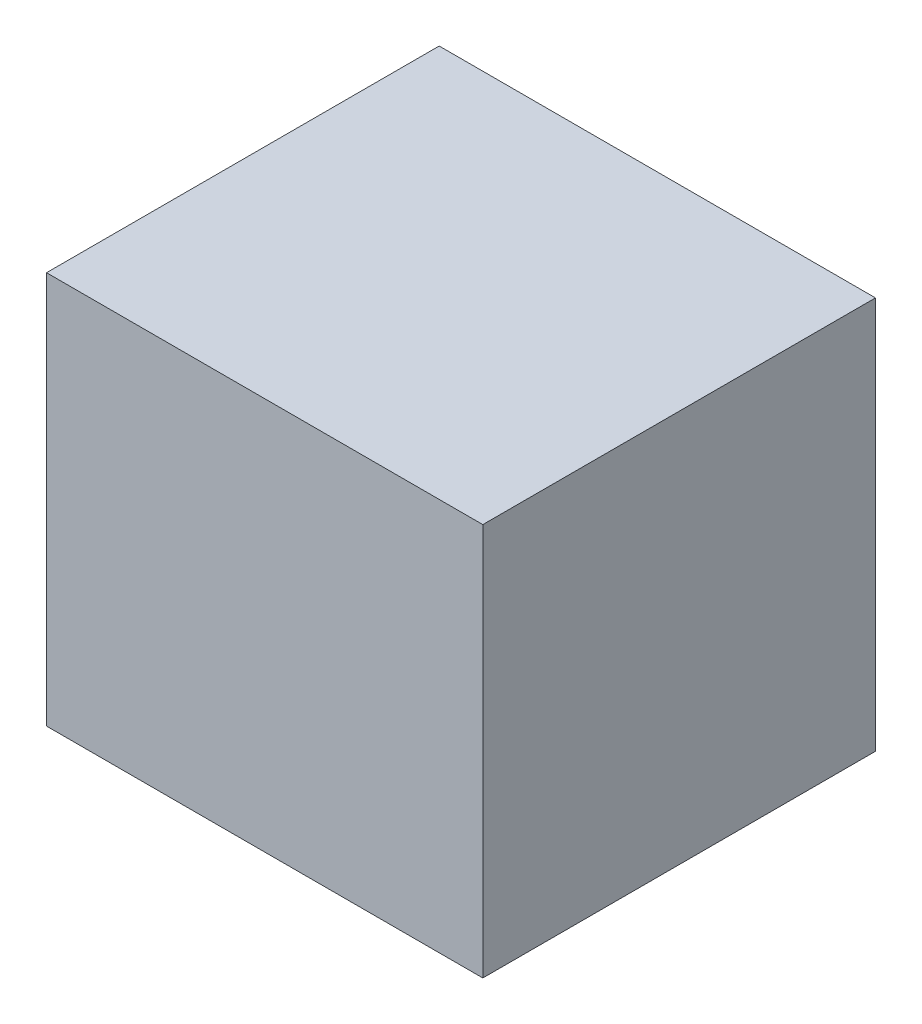
ISO-10303-21;
HEADER;
FILE_DESCRIPTION(('STEP AP214'),'2;1');
FILE_NAME('part.step','',(''),(''),'','','');
FILE_SCHEMA(('AUTOMOTIVE_DESIGN { 1 0 10303 214 1 1 1 1 }'));
ENDSEC;
DATA;
#1=APPLICATION_CONTEXT('core data for automotive mechanical design processes');
#2=APPLICATION_PROTOCOL_DEFINITION('international standard','automotive_design',2000,#1);
#3=PRODUCT_CONTEXT('',#1,'mechanical');
#4=PRODUCT('Part','Part','',(#3));
#5=PRODUCT_RELATED_PRODUCT_CATEGORY('part','',(#4));
#6=PRODUCT_DEFINITION_FORMATION('','',#4);
#7=PRODUCT_DEFINITION_CONTEXT('part definition',#1,'design');
#8=PRODUCT_DEFINITION('design','',#6,#7);
#9=PRODUCT_DEFINITION_SHAPE('','',#8);
#10=(LENGTH_UNIT() NAMED_UNIT(*) SI_UNIT(.MILLI.,.METRE.));
#11=(NAMED_UNIT(*) PLANE_ANGLE_UNIT() SI_UNIT($,.RADIAN.));
#12=(NAMED_UNIT(*) SI_UNIT($,.STERADIAN.) SOLID_ANGLE_UNIT());
#13=UNCERTAINTY_MEASURE_WITH_UNIT(LENGTH_MEASURE(1.E-05),#10,'distance_accuracy_value','');
#14=(GEOMETRIC_REPRESENTATION_CONTEXT(3) GLOBAL_UNCERTAINTY_ASSIGNED_CONTEXT((#13)) GLOBAL_UNIT_ASSIGNED_CONTEXT((#10,
#11,#12)) REPRESENTATION_CONTEXT('',''));
#15=CARTESIAN_POINT('',(0.,0.,0.));
#16=DIRECTION('',(0.,0.,1.));
#17=DIRECTION('',(1.,0.,0.));
#18=AXIS2_PLACEMENT_3D('',#15,#16,#17);
#19=CARTESIAN_POINT('',(0.499999,0.4499991,0.));
#20=DIRECTION('',(0.,-1.,0.));
#21=DIRECTION('',(0.,0.,-1.));
#22=AXIS2_PLACEMENT_3D('',#19,#20,#21);
#23=PLANE('',#22);
#24=DIRECTION('',(0.,0.,-1.));
#25=VECTOR('',#24,1.);
#26=CARTESIAN_POINT('',(-0.499999,0.4499991,0.));
#27=LINE('',#26,#25);
#28=CARTESIAN_POINT('',(-0.499999,0.4499991,0.));
#29=VERTEX_POINT('',#28);
#30=CARTESIAN_POINT('',(-0.499999,0.4499991,0.90000074));
#31=VERTEX_POINT('',#30);
#32=EDGE_CURVE('E20',#29,#31,#27,.F.);
#33=ORIENTED_EDGE('',*,*,#32,.T.);
#34=DIRECTION('',(-1.,0.,0.));
#35=VECTOR('',#34,1.);
#36=CARTESIAN_POINT('',(-0.499999,0.4499991,0.90000074));
#37=LINE('',#36,#35);
#38=CARTESIAN_POINT('',(0.499999,0.4499991,0.90000074));
#39=VERTEX_POINT('',#38);
#40=EDGE_CURVE('E55',#31,#39,#37,.F.);
#41=ORIENTED_EDGE('',*,*,#40,.T.);
#42=DIRECTION('',(0.,0.,1.));
#43=VECTOR('',#42,1.);
#44=CARTESIAN_POINT('',(0.499999,0.4499991,0.));
#45=LINE('',#44,#43);
#46=CARTESIAN_POINT('',(0.499999,0.4499991,0.));
#47=VERTEX_POINT('',#46);
#48=EDGE_CURVE('E74',#39,#47,#45,.F.);
#49=ORIENTED_EDGE('',*,*,#48,.T.);
#50=DIRECTION('',(-1.,0.,0.));
#51=VECTOR('',#50,1.);
#52=CARTESIAN_POINT('',(-0.499999,0.4499991,0.));
#53=LINE('',#52,#51);
#54=EDGE_CURVE('E66',#29,#47,#53,.F.);
#55=ORIENTED_EDGE('',*,*,#54,.F.);
#56=EDGE_LOOP('',(#33,#41,#49,#55));
#57=FACE_BOUND('',#56,.T.);
#58=ADVANCED_FACE('F17',(#57),#23,.F.);
#59=CARTESIAN_POINT('',(-0.499999,0.4499991,0.));
#60=DIRECTION('',(1.,0.,0.));
#61=DIRECTION('',(0.,0.,-1.));
#62=AXIS2_PLACEMENT_3D('',#59,#60,#61);
#63=PLANE('',#62);
#64=DIRECTION('',(0.,0.,1.));
#65=VECTOR('',#64,1.);
#66=CARTESIAN_POINT('',(-0.499999,-0.4499991,0.));
#67=LINE('',#66,#65);
#68=CARTESIAN_POINT('',(-0.499999,-0.4499991,0.));
#69=VERTEX_POINT('',#68);
#70=CARTESIAN_POINT('',(-0.499999,-0.4499991,0.90000074));
#71=VERTEX_POINT('',#70);
#72=EDGE_CURVE('E72',#69,#71,#67,.T.);
#73=ORIENTED_EDGE('',*,*,#72,.T.);
#74=DIRECTION('',(0.,1.,0.));
#75=VECTOR('',#74,1.);
#76=CARTESIAN_POINT('',(-0.499999,0.4499991,0.90000074));
#77=LINE('',#76,#75);
#78=EDGE_CURVE('E62',#71,#31,#77,.T.);
#79=ORIENTED_EDGE('',*,*,#78,.T.);
#80=ORIENTED_EDGE('',*,*,#32,.F.);
#81=DIRECTION('',(0.,1.,0.));
#82=VECTOR('',#81,1.);
#83=CARTESIAN_POINT('',(-0.499999,0.4499991,0.));
#84=LINE('',#83,#82);
#85=EDGE_CURVE('E80',#69,#29,#84,.T.);
#86=ORIENTED_EDGE('',*,*,#85,.F.);
#87=EDGE_LOOP('',(#73,#79,#80,#86));
#88=FACE_BOUND('',#87,.T.);
#89=ADVANCED_FACE('F71',(#88),#63,.F.);
#90=CARTESIAN_POINT('',(-0.499999,0.4499991,0.90000074));
#91=DIRECTION('',(0.,0.,-1.));
#92=DIRECTION('',(-1.,0.,0.));
#93=AXIS2_PLACEMENT_3D('',#90,#91,#92);
#94=PLANE('',#93);
#95=DIRECTION('',(1.,0.,0.));
#96=VECTOR('',#95,1.);
#97=CARTESIAN_POINT('',(-0.499999,-0.4499991,0.90000074));
#98=LINE('',#97,#96);
#99=CARTESIAN_POINT('',(0.499999,-0.4499991,0.90000074));
#100=VERTEX_POINT('',#99);
#101=EDGE_CURVE('E83',#71,#100,#98,.T.);
#102=ORIENTED_EDGE('',*,*,#101,.T.);
#103=DIRECTION('',(0.,1.,0.));
#104=VECTOR('',#103,1.);
#105=CARTESIAN_POINT('',(0.499999,-0.4499991,0.90000074));
#106=LINE('',#105,#104);
#107=EDGE_CURVE('E64',#100,#39,#106,.T.);
#108=ORIENTED_EDGE('',*,*,#107,.T.);
#109=ORIENTED_EDGE('',*,*,#40,.F.);
#110=ORIENTED_EDGE('',*,*,#78,.F.);
#111=EDGE_LOOP('',(#102,#108,#109,#110));
#112=FACE_BOUND('',#111,.T.);
#113=ADVANCED_FACE('F60',(#112),#94,.F.);
#114=CARTESIAN_POINT('',(0.499999,-0.4499991,0.));
#115=DIRECTION('',(-1.,0.,0.));
#116=DIRECTION('',(0.,0.,1.));
#117=AXIS2_PLACEMENT_3D('',#114,#115,#116);
#118=PLANE('',#117);
#119=ORIENTED_EDGE('',*,*,#48,.F.);
#120=ORIENTED_EDGE('',*,*,#107,.F.);
#121=DIRECTION('',(0.,0.,1.));
#122=VECTOR('',#121,1.);
#123=CARTESIAN_POINT('',(0.499999,-0.4499991,0.));
#124=LINE('',#123,#122);
#125=CARTESIAN_POINT('',(0.499999,-0.4499991,0.));
#126=VERTEX_POINT('',#125);
#127=EDGE_CURVE('E26',#100,#126,#124,.F.);
#128=ORIENTED_EDGE('',*,*,#127,.T.);
#129=DIRECTION('',(0.,1.,0.));
#130=VECTOR('',#129,1.);
#131=CARTESIAN_POINT('',(0.499999,0.4499991,0.));
#132=LINE('',#131,#130);
#133=EDGE_CURVE('E34',#47,#126,#132,.F.);
#134=ORIENTED_EDGE('',*,*,#133,.F.);
#135=EDGE_LOOP('',(#119,#120,#128,#134));
#136=FACE_BOUND('',#135,.T.);
#137=ADVANCED_FACE('F88',(#136),#118,.F.);
#138=CARTESIAN_POINT('',(-0.499999,0.4499991,0.));
#139=DIRECTION('',(0.,0.,-1.));
#140=DIRECTION('',(-1.,0.,0.));
#141=AXIS2_PLACEMENT_3D('',#138,#139,#140);
#142=PLANE('',#141);
#143=DIRECTION('',(1.,0.,0.));
#144=VECTOR('',#143,1.);
#145=CARTESIAN_POINT('',(-0.499999,-0.4499991,0.));
#146=LINE('',#145,#144);
#147=EDGE_CURVE('E11',#126,#69,#146,.F.);
#148=ORIENTED_EDGE('',*,*,#147,.T.);
#149=ORIENTED_EDGE('',*,*,#85,.T.);
#150=ORIENTED_EDGE('',*,*,#54,.T.);
#151=ORIENTED_EDGE('',*,*,#133,.T.);
#152=EDGE_LOOP('',(#148,#149,#150,#151));
#153=FACE_BOUND('',#152,.T.);
#154=ADVANCED_FACE('F91',(#153),#142,.T.);
#155=CARTESIAN_POINT('',(-0.499999,-0.4499991,0.));
#156=DIRECTION('',(0.,1.,0.));
#157=DIRECTION('',(0.,0.,1.));
#158=AXIS2_PLACEMENT_3D('',#155,#156,#157);
#159=PLANE('',#158);
#160=ORIENTED_EDGE('',*,*,#127,.F.);
#161=ORIENTED_EDGE('',*,*,#101,.F.);
#162=ORIENTED_EDGE('',*,*,#72,.F.);
#163=ORIENTED_EDGE('',*,*,#147,.F.);
#164=EDGE_LOOP('',(#160,#161,#162,#163));
#165=FACE_BOUND('',#164,.T.);
#166=ADVANCED_FACE('F90',(#165),#159,.F.);
#167=CLOSED_SHELL('',(#58,#89,#113,#137,#154,#166));
#168=MANIFOLD_SOLID_BREP('B1',#167);
#169=ADVANCED_BREP_SHAPE_REPRESENTATION('',(#18,#168),#14);
#170=SHAPE_DEFINITION_REPRESENTATION(#9,#169);
ENDSEC;
END-ISO-10303-21;
